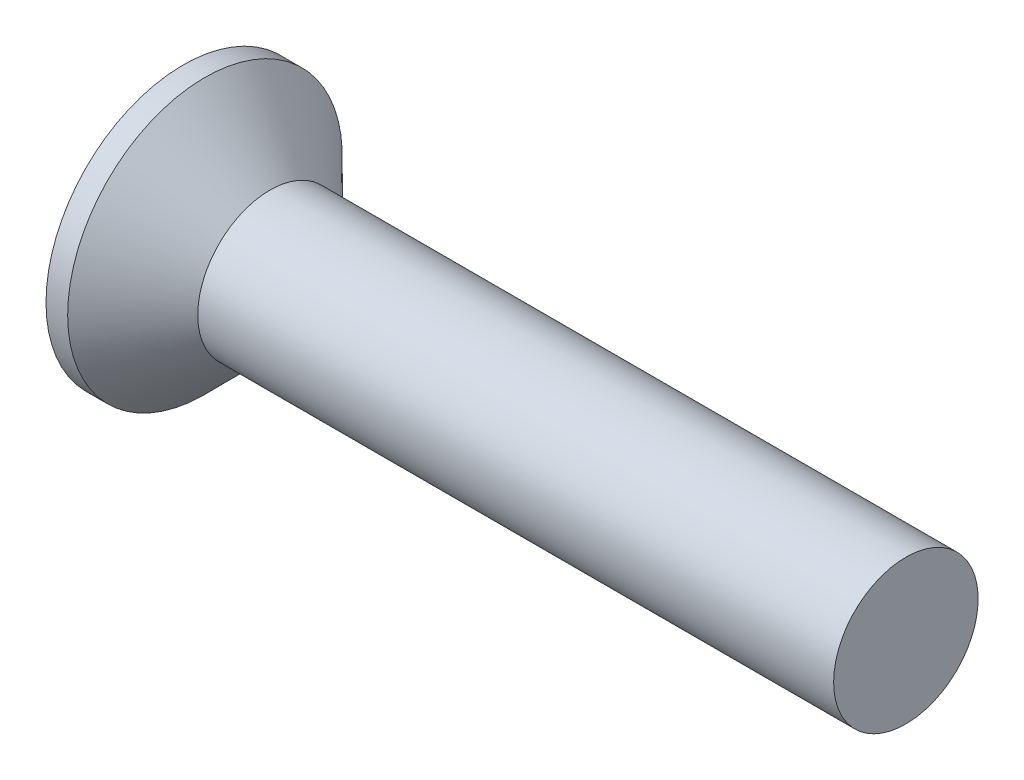
ISO-10303-21;
HEADER;
FILE_DESCRIPTION(('STEP AP214'),'2;1');
FILE_NAME('part.step','',(''),(''),'','','');
FILE_SCHEMA(('AUTOMOTIVE_DESIGN { 1 0 10303 214 1 1 1 1 }'));
ENDSEC;
DATA;
#1=APPLICATION_CONTEXT('core data for automotive mechanical design processes');
#2=APPLICATION_PROTOCOL_DEFINITION('international standard','automotive_design',2000,#1);
#3=PRODUCT_CONTEXT('',#1,'mechanical');
#4=PRODUCT('Part','Part','',(#3));
#5=PRODUCT_RELATED_PRODUCT_CATEGORY('part','',(#4));
#6=PRODUCT_DEFINITION_FORMATION('','',#4);
#7=PRODUCT_DEFINITION_CONTEXT('part definition',#1,'design');
#8=PRODUCT_DEFINITION('design','',#6,#7);
#9=PRODUCT_DEFINITION_SHAPE('','',#8);
#10=(LENGTH_UNIT() NAMED_UNIT(*) SI_UNIT(.MILLI.,.METRE.));
#11=(NAMED_UNIT(*) PLANE_ANGLE_UNIT() SI_UNIT($,.RADIAN.));
#12=(NAMED_UNIT(*) SI_UNIT($,.STERADIAN.) SOLID_ANGLE_UNIT());
#13=UNCERTAINTY_MEASURE_WITH_UNIT(LENGTH_MEASURE(1.E-05),#10,'distance_accuracy_value','');
#14=(GEOMETRIC_REPRESENTATION_CONTEXT(3) GLOBAL_UNCERTAINTY_ASSIGNED_CONTEXT((#13)) GLOBAL_UNIT_ASSIGNED_CONTEXT((#10,
#11,#12)) REPRESENTATION_CONTEXT('',''));
#15=CARTESIAN_POINT('',(0.,0.,0.));
#16=DIRECTION('',(0.,0.,1.));
#17=DIRECTION('',(1.,0.,0.));
#18=AXIS2_PLACEMENT_3D('',#15,#16,#17);
#19=CARTESIAN_POINT('',(0.,0.,0.));
#20=DIRECTION('',(-1.,0.,0.));
#21=DIRECTION('',(0.,0.,1.));
#22=AXIS2_PLACEMENT_3D('',#19,#20,#21);
#23=PLANE('',#22);
#24=CARTESIAN_POINT('',(0.,0.,0.));
#25=DIRECTION('',(-1.,0.,0.));
#26=DIRECTION('',(0.,0.,1.));
#27=AXIS2_PLACEMENT_3D('',#24,#25,#26);
#28=CIRCLE('',#27,1.9);
#29=CARTESIAN_POINT('',(0.,0.,1.9));
#30=VERTEX_POINT('',#29);
#31=EDGE_CURVE('E57',#30,#30,#28,.T.);
#32=ORIENTED_EDGE('',*,*,#31,.T.);
#33=EDGE_LOOP('',(#32));
#34=FACE_BOUND('',#33,.T.);
#35=DIRECTION('',(0.,1.,0.));
#36=VECTOR('',#35,1.);
#37=CARTESIAN_POINT('',(0.,-1.07,-0.264999999999999));
#38=LINE('',#37,#36);
#39=CARTESIAN_POINT('',(0.,-1.07,-0.264999999999999));
#40=VERTEX_POINT('',#39);
#41=CARTESIAN_POINT('',(0.,-0.264999999999999,-0.264999999999999));
#42=VERTEX_POINT('',#41);
#43=EDGE_CURVE('E119',#40,#42,#38,.T.);
#44=ORIENTED_EDGE('',*,*,#43,.T.);
#45=DIRECTION('',(0.,0.,-1.));
#46=VECTOR('',#45,1.);
#47=CARTESIAN_POINT('',(0.,-0.265000000000004,1.07));
#48=LINE('',#47,#46);
#49=CARTESIAN_POINT('',(0.,-0.264999999999996,-1.07));
#50=VERTEX_POINT('',#49);
#51=EDGE_CURVE('E98',#42,#50,#48,.T.);
#52=ORIENTED_EDGE('',*,*,#51,.T.);
#53=DIRECTION('',(0.,1.,0.));
#54=VECTOR('',#53,1.);
#55=CARTESIAN_POINT('',(0.,-0.264999999999996,-1.07));
#56=LINE('',#55,#54);
#57=CARTESIAN_POINT('',(0.,0.265000000000003,-1.07));
#58=VERTEX_POINT('',#57);
#59=EDGE_CURVE('E362',#50,#58,#56,.T.);
#60=ORIENTED_EDGE('',*,*,#59,.T.);
#61=DIRECTION('',(0.,0.,1.));
#62=VECTOR('',#61,1.);
#63=CARTESIAN_POINT('',(0.,0.265000000000003,-1.07));
#64=LINE('',#63,#62);
#65=CARTESIAN_POINT('',(0.,0.265,-0.264999999999999));
#66=VERTEX_POINT('',#65);
#67=EDGE_CURVE('E114',#58,#66,#64,.T.);
#68=ORIENTED_EDGE('',*,*,#67,.T.);
#69=CARTESIAN_POINT('',(0.,1.07,-0.264999999999999));
#70=VERTEX_POINT('',#69);
#71=EDGE_CURVE('E108',#66,#70,#38,.T.);
#72=ORIENTED_EDGE('',*,*,#71,.T.);
#73=DIRECTION('',(0.,0.,1.));
#74=VECTOR('',#73,1.);
#75=CARTESIAN_POINT('',(0.,1.07,-0.264999999999999));
#76=LINE('',#75,#74);
#77=CARTESIAN_POINT('',(0.,1.07,0.265));
#78=VERTEX_POINT('',#77);
#79=EDGE_CURVE('E111',#70,#78,#76,.T.);
#80=ORIENTED_EDGE('',*,*,#79,.T.);
#81=DIRECTION('',(0.,-1.,0.));
#82=VECTOR('',#81,1.);
#83=CARTESIAN_POINT('',(0.,1.07,0.265));
#84=LINE('',#83,#82);
#85=CARTESIAN_POINT('',(0.,0.264999999999998,0.265));
#86=VERTEX_POINT('',#85);
#87=EDGE_CURVE('E381',#78,#86,#84,.T.);
#88=ORIENTED_EDGE('',*,*,#87,.T.);
#89=CARTESIAN_POINT('',(0.,0.264999999999995,1.07));
#90=VERTEX_POINT('',#89);
#91=EDGE_CURVE('E353',#86,#90,#64,.T.);
#92=ORIENTED_EDGE('',*,*,#91,.T.);
#93=DIRECTION('',(0.,-1.,0.));
#94=VECTOR('',#93,1.);
#95=CARTESIAN_POINT('',(0.,0.264999999999995,1.07));
#96=LINE('',#95,#94);
#97=CARTESIAN_POINT('',(0.,-0.265000000000004,1.07));
#98=VERTEX_POINT('',#97);
#99=EDGE_CURVE('E338',#90,#98,#96,.T.);
#100=ORIENTED_EDGE('',*,*,#99,.T.);
#101=CARTESIAN_POINT('',(0.,-0.265000000000001,0.265));
#102=VERTEX_POINT('',#101);
#103=EDGE_CURVE('E351',#98,#102,#48,.T.);
#104=ORIENTED_EDGE('',*,*,#103,.T.);
#105=CARTESIAN_POINT('',(0.,-1.07,0.265));
#106=VERTEX_POINT('',#105);
#107=EDGE_CURVE('E126',#102,#106,#84,.T.);
#108=ORIENTED_EDGE('',*,*,#107,.T.);
#109=DIRECTION('',(0.,0.,-1.));
#110=VECTOR('',#109,1.);
#111=CARTESIAN_POINT('',(0.,-1.07,0.265));
#112=LINE('',#111,#110);
#113=EDGE_CURVE('E156',#106,#40,#112,.T.);
#114=ORIENTED_EDGE('',*,*,#113,.T.);
#115=EDGE_LOOP('',(#44,#52,#60,#68,#72,#80,#88,#92,#100,#104,#108,#114));
#116=FACE_BOUND('',#115,.T.);
#117=ADVANCED_FACE('F49',(#34,#116),#23,.T.);
#118=CARTESIAN_POINT('',(1.75765333333333,0.,0.113773333333333));
#119=DIRECTION('',(-0.0857222578731988,0.,-0.996319072639443));
#120=DIRECTION('',(-0.996319072639444,0.,0.0857222578731988));
#121=AXIS2_PLACEMENT_3D('',#118,#119,#120);
#122=PLANE('',#121);
#123=ORIENTED_EDGE('',*,*,#107,.F.);
#124=DIRECTION('',(0.992678495991953,0.0854090264408663,-0.085409026440866));
#125=VECTOR('',#124,1.);
#126=CARTESIAN_POINT('',(1.76729945793969,-0.112943390794151,0.112943390794151));
#127=LINE('',#126,#125);
#128=CARTESIAN_POINT('',(1.54,-0.132500000000001,0.1325));
#129=VERTEX_POINT('',#128);
#130=EDGE_CURVE('E150',#102,#129,#127,.T.);
#131=ORIENTED_EDGE('',*,*,#130,.T.);
#132=DIRECTION('',(0.851874354386278,0.518592342361776,-0.073294384387131));
#133=VECTOR('',#132,1.);
#134=CARTESIAN_POINT('',(0.,-1.07,0.265));
#135=LINE('',#134,#133);
#136=EDGE_CURVE('E120',#106,#129,#135,.T.);
#137=ORIENTED_EDGE('',*,*,#136,.F.);
#138=EDGE_LOOP('',(#123,#131,#137));
#139=FACE_BOUND('',#138,.T.);
#140=ADVANCED_FACE('F182',(#139),#122,.T.);
#141=DIRECTION('',(0.851874354386278,-0.518592342361776,-0.0732943843871309));
#142=VECTOR('',#141,1.);
#143=CARTESIAN_POINT('',(0.,1.07,0.265));
#144=LINE('',#143,#142);
#145=CARTESIAN_POINT('',(1.54,0.1325,0.1325));
#146=VERTEX_POINT('',#145);
#147=EDGE_CURVE('E64',#78,#146,#144,.T.);
#148=ORIENTED_EDGE('',*,*,#147,.T.);
#149=DIRECTION('',(-0.992678495991953,0.0854090264408653,0.085409026440866));
#150=VECTOR('',#149,1.);
#151=CARTESIAN_POINT('',(1.76729945793969,0.11294339079415,0.112943390794151));
#152=LINE('',#151,#150);
#153=EDGE_CURVE('E375',#146,#86,#152,.T.);
#154=ORIENTED_EDGE('',*,*,#153,.T.);
#155=ORIENTED_EDGE('',*,*,#87,.F.);
#156=EDGE_LOOP('',(#148,#154,#155));
#157=FACE_BOUND('',#156,.T.);
#158=ADVANCED_FACE('F187',(#157),#122,.T.);
#159=CARTESIAN_POINT('',(1.75765333333333,0.,-0.113773333333333));
#160=DIRECTION('',(-0.0857222578731983,0.,0.996319072639443));
#161=DIRECTION('',(0.996319072639444,0.,0.0857222578731983));
#162=AXIS2_PLACEMENT_3D('',#159,#160,#161);
#163=PLANE('',#162);
#164=DIRECTION('',(0.851874354386278,0.518592342361776,0.0732943843871306));
#165=VECTOR('',#164,1.);
#166=CARTESIAN_POINT('',(0.,-1.07,-0.264999999999999));
#167=LINE('',#166,#165);
#168=CARTESIAN_POINT('',(1.54,-0.1325,-0.132500000000001));
#169=VERTEX_POINT('',#168);
#170=EDGE_CURVE('E73',#40,#169,#167,.T.);
#171=ORIENTED_EDGE('',*,*,#170,.T.);
#172=DIRECTION('',(-0.992678495991953,-0.0854090264408657,-0.0854090264408656));
#173=VECTOR('',#172,1.);
#174=CARTESIAN_POINT('',(1.76729945793969,-0.11294339079415,-0.11294339079415));
#175=LINE('',#174,#173);
#176=EDGE_CURVE('E11',#169,#42,#175,.T.);
#177=ORIENTED_EDGE('',*,*,#176,.T.);
#178=ORIENTED_EDGE('',*,*,#43,.F.);
#179=EDGE_LOOP('',(#171,#177,#178));
#180=FACE_BOUND('',#179,.T.);
#181=ADVANCED_FACE('F179',(#180),#163,.T.);
#182=ORIENTED_EDGE('',*,*,#71,.F.);
#183=DIRECTION('',(0.992678495991953,-0.0854090264408659,0.0854090264408656));
#184=VECTOR('',#183,1.);
#185=CARTESIAN_POINT('',(1.76729945793969,0.112943390794151,-0.11294339079415));
#186=LINE('',#185,#184);
#187=CARTESIAN_POINT('',(1.54,0.1325,-0.1325));
#188=VERTEX_POINT('',#187);
#189=EDGE_CURVE('E129',#66,#188,#186,.T.);
#190=ORIENTED_EDGE('',*,*,#189,.T.);
#191=DIRECTION('',(0.851874354386278,-0.518592342361776,0.0732943843871306));
#192=VECTOR('',#191,1.);
#193=CARTESIAN_POINT('',(0.,1.07,-0.264999999999999));
#194=LINE('',#193,#192);
#195=EDGE_CURVE('E124',#70,#188,#194,.T.);
#196=ORIENTED_EDGE('',*,*,#195,.F.);
#197=EDGE_LOOP('',(#182,#190,#196));
#198=FACE_BOUND('',#197,.T.);
#199=ADVANCED_FACE('F128',(#198),#163,.T.);
#200=CARTESIAN_POINT('',(-6.34999999999999,0.,0.));
#201=DIRECTION('',(-1.,0.,0.));
#202=DIRECTION('',(0.,0.,1.));
#203=AXIS2_PLACEMENT_3D('',#200,#201,#202);
#204=CYLINDRICAL_SURFACE('',#203,1.9);
#205=CARTESIAN_POINT('',(0.300000000000004,0.,0.));
#206=DIRECTION('',(-1.,0.,0.));
#207=DIRECTION('',(0.,0.,1.));
#208=AXIS2_PLACEMENT_3D('',#205,#206,#207);
#209=CIRCLE('',#208,1.9);
#210=CARTESIAN_POINT('',(0.300000000000004,0.,1.9));
#211=VERTEX_POINT('',#210);
#212=EDGE_CURVE('E160',#211,#211,#209,.T.);
#213=ORIENTED_EDGE('',*,*,#212,.T.);
#214=EDGE_LOOP('',(#213));
#215=FACE_BOUND('',#214,.T.);
#216=ORIENTED_EDGE('',*,*,#31,.F.);
#217=EDGE_LOOP('',(#216));
#218=FACE_BOUND('',#217,.T.);
#219=ADVANCED_FACE('F168',(#215,#218),#204,.T.);
#220=CARTESIAN_POINT('',(0.300000000000004,0.,0.));
#221=DIRECTION('',(-1.,0.,0.));
#222=DIRECTION('',(0.,0.,1.));
#223=AXIS2_PLACEMENT_3D('',#220,#221,#222);
#224=CONICAL_SURFACE('',#223,1.9,0.785398163397451);
#225=CARTESIAN_POINT('',(1.2,0.,0.));
#226=DIRECTION('',(-1.,0.,0.));
#227=DIRECTION('',(0.,0.,1.));
#228=AXIS2_PLACEMENT_3D('',#225,#226,#227);
#229=CIRCLE('',#228,1.);
#230=CARTESIAN_POINT('',(1.2,0.,1.));
#231=VERTEX_POINT('',#230);
#232=EDGE_CURVE('E155',#231,#231,#229,.T.);
#233=ORIENTED_EDGE('',*,*,#232,.T.);
#234=EDGE_LOOP('',(#233));
#235=FACE_BOUND('',#234,.T.);
#236=ORIENTED_EDGE('',*,*,#212,.F.);
#237=EDGE_LOOP('',(#236));
#238=FACE_BOUND('',#237,.T.);
#239=ADVANCED_FACE('F170',(#235,#238),#224,.T.);
#240=CARTESIAN_POINT('',(-6.34999999999999,0.,0.));
#241=DIRECTION('',(-1.,0.,0.));
#242=DIRECTION('',(0.,0.,1.));
#243=AXIS2_PLACEMENT_3D('',#240,#241,#242);
#244=CYLINDRICAL_SURFACE('',#243,1.);
#245=CARTESIAN_POINT('',(10.,0.,0.));
#246=DIRECTION('',(-1.,0.,0.));
#247=DIRECTION('',(0.,0.,1.));
#248=AXIS2_PLACEMENT_3D('',#245,#246,#247);
#249=CIRCLE('',#248,1.);
#250=CARTESIAN_POINT('',(10.,0.,1.));
#251=VERTEX_POINT('',#250);
#252=EDGE_CURVE('E151',#251,#251,#249,.T.);
#253=ORIENTED_EDGE('',*,*,#252,.T.);
#254=EDGE_LOOP('',(#253));
#255=FACE_BOUND('',#254,.T.);
#256=ORIENTED_EDGE('',*,*,#232,.F.);
#257=EDGE_LOOP('',(#256));
#258=FACE_BOUND('',#257,.T.);
#259=ADVANCED_FACE('F175',(#255,#258),#244,.T.);
#260=CARTESIAN_POINT('',(10.,1.,0.));
#261=DIRECTION('',(1.,0.,0.));
#262=DIRECTION('',(0.,0.,-1.));
#263=AXIS2_PLACEMENT_3D('',#260,#261,#262);
#264=PLANE('',#263);
#265=ORIENTED_EDGE('',*,*,#252,.F.);
#266=EDGE_LOOP('',(#265));
#267=FACE_BOUND('',#266,.T.);
#268=ADVANCED_FACE('F207',(#267),#264,.T.);
#269=CARTESIAN_POINT('',(1.54,0.1325,-0.1325));
#270=DIRECTION('',(1.,0.,0.));
#271=DIRECTION('',(0.,0.,-1.));
#272=AXIS2_PLACEMENT_3D('',#269,#270,#271);
#273=PLANE('',#272);
#274=DIRECTION('',(0.,1.,0.));
#275=VECTOR('',#274,1.);
#276=CARTESIAN_POINT('',(1.54,-0.1325,-0.1325));
#277=LINE('',#276,#275);
#278=EDGE_CURVE('E144',#169,#188,#277,.T.);
#279=ORIENTED_EDGE('',*,*,#278,.F.);
#280=DIRECTION('',(0.,0.,-1.));
#281=VECTOR('',#280,1.);
#282=CARTESIAN_POINT('',(1.54,-0.1325,0.1325));
#283=LINE('',#282,#281);
#284=EDGE_CURVE('E132',#129,#169,#283,.T.);
#285=ORIENTED_EDGE('',*,*,#284,.F.);
#286=DIRECTION('',(0.,-1.,0.));
#287=VECTOR('',#286,1.);
#288=CARTESIAN_POINT('',(1.54,0.1325,0.1325));
#289=LINE('',#288,#287);
#290=EDGE_CURVE('E137',#146,#129,#289,.T.);
#291=ORIENTED_EDGE('',*,*,#290,.F.);
#292=DIRECTION('',(0.,0.,1.));
#293=VECTOR('',#292,1.);
#294=CARTESIAN_POINT('',(1.54,0.1325,-0.1325));
#295=LINE('',#294,#293);
#296=EDGE_CURVE('E141',#188,#146,#295,.T.);
#297=ORIENTED_EDGE('',*,*,#296,.F.);
#298=EDGE_LOOP('',(#279,#285,#291,#297));
#299=FACE_BOUND('',#298,.T.);
#300=ADVANCED_FACE('F204',(#299),#273,.F.);
#301=CARTESIAN_POINT('',(1.54,-0.1325,-0.1325));
#302=DIRECTION('',(-0.519990936244092,0.854171777936963,0.));
#303=DIRECTION('',(-0.854171777936963,-0.519990936244092,0.));
#304=AXIS2_PLACEMENT_3D('',#301,#302,#303);
#305=PLANE('',#304);
#306=ORIENTED_EDGE('',*,*,#170,.F.);
#307=ORIENTED_EDGE('',*,*,#113,.F.);
#308=ORIENTED_EDGE('',*,*,#136,.T.);
#309=ORIENTED_EDGE('',*,*,#284,.T.);
#310=EDGE_LOOP('',(#306,#307,#308,#309));
#311=FACE_BOUND('',#310,.T.);
#312=ADVANCED_FACE('F196',(#311),#305,.T.);
#313=CARTESIAN_POINT('',(0.,1.07,0.265));
#314=DIRECTION('',(-0.519990936244092,-0.854171777936963,0.));
#315=DIRECTION('',(0.854171777936963,-0.519990936244092,0.));
#316=AXIS2_PLACEMENT_3D('',#313,#314,#315);
#317=PLANE('',#316);
#318=ORIENTED_EDGE('',*,*,#147,.F.);
#319=ORIENTED_EDGE('',*,*,#79,.F.);
#320=ORIENTED_EDGE('',*,*,#195,.T.);
#321=ORIENTED_EDGE('',*,*,#296,.T.);
#322=EDGE_LOOP('',(#318,#319,#320,#321));
#323=FACE_BOUND('',#322,.T.);
#324=ADVANCED_FACE('F123',(#323),#317,.T.);
#325=CARTESIAN_POINT('',(1.75765333333333,-0.113773333333333,0.));
#326=DIRECTION('',(-0.0857222578731988,0.996319072639443,0.));
#327=DIRECTION('',(-0.996319072639444,-0.0857222578731988,0.));
#328=AXIS2_PLACEMENT_3D('',#325,#326,#327);
#329=PLANE('',#328);
#330=DIRECTION('',(0.851874354386278,0.0732943843871292,0.518592342361776));
#331=VECTOR('',#330,1.);
#332=CARTESIAN_POINT('',(0.,-0.264999999999996,-1.07));
#333=LINE('',#332,#331);
#334=EDGE_CURVE('E365',#50,#169,#333,.T.);
#335=ORIENTED_EDGE('',*,*,#334,.F.);
#336=ORIENTED_EDGE('',*,*,#51,.F.);
#337=ORIENTED_EDGE('',*,*,#176,.F.);
#338=EDGE_LOOP('',(#335,#336,#337));
#339=FACE_BOUND('',#338,.T.);
#340=ADVANCED_FACE('F203',(#339),#329,.T.);
#341=CARTESIAN_POINT('',(1.75765333333333,0.113773333333333,0.));
#342=DIRECTION('',(-0.0857222578731983,-0.996319072639443,0.));
#343=DIRECTION('',(0.996319072639444,-0.0857222578731983,0.));
#344=AXIS2_PLACEMENT_3D('',#341,#342,#343);
#345=PLANE('',#344);
#346=ORIENTED_EDGE('',*,*,#67,.F.);
#347=DIRECTION('',(0.851874354386278,-0.0732943843871324,0.518592342361776));
#348=VECTOR('',#347,1.);
#349=CARTESIAN_POINT('',(0.,0.265000000000003,-1.07));
#350=LINE('',#349,#348);
#351=EDGE_CURVE('E89',#58,#188,#350,.T.);
#352=ORIENTED_EDGE('',*,*,#351,.T.);
#353=ORIENTED_EDGE('',*,*,#189,.F.);
#354=EDGE_LOOP('',(#346,#352,#353));
#355=FACE_BOUND('',#354,.T.);
#356=ADVANCED_FACE('F283',(#355),#345,.T.);
#357=CARTESIAN_POINT('',(1.54,0.1325,-0.1325));
#358=DIRECTION('',(-0.519990936244092,0.,0.854171777936963));
#359=DIRECTION('',(-0.854171777936963,0.,-0.519990936244092));
#360=AXIS2_PLACEMENT_3D('',#357,#358,#359);
#361=PLANE('',#360);
#362=ORIENTED_EDGE('',*,*,#351,.F.);
#363=ORIENTED_EDGE('',*,*,#59,.F.);
#364=ORIENTED_EDGE('',*,*,#334,.T.);
#365=ORIENTED_EDGE('',*,*,#278,.T.);
#366=EDGE_LOOP('',(#362,#363,#364,#365));
#367=FACE_BOUND('',#366,.T.);
#368=ADVANCED_FACE('F293',(#367),#361,.T.);
#369=ORIENTED_EDGE('',*,*,#103,.F.);
#370=DIRECTION('',(0.851874354386278,0.0732943843871327,-0.518592342361776));
#371=VECTOR('',#370,1.);
#372=CARTESIAN_POINT('',(0.,-0.265000000000004,1.07));
#373=LINE('',#372,#371);
#374=EDGE_CURVE('E335',#98,#129,#373,.T.);
#375=ORIENTED_EDGE('',*,*,#374,.T.);
#376=ORIENTED_EDGE('',*,*,#130,.F.);
#377=EDGE_LOOP('',(#369,#375,#376));
#378=FACE_BOUND('',#377,.T.);
#379=ADVANCED_FACE('F285',(#378),#329,.T.);
#380=DIRECTION('',(0.851874354386278,-0.0732943843871288,-0.518592342361776));
#381=VECTOR('',#380,1.);
#382=CARTESIAN_POINT('',(0.,0.264999999999995,1.07));
#383=LINE('',#382,#381);
#384=EDGE_CURVE('E347',#90,#146,#383,.T.);
#385=ORIENTED_EDGE('',*,*,#384,.F.);
#386=ORIENTED_EDGE('',*,*,#91,.F.);
#387=ORIENTED_EDGE('',*,*,#153,.F.);
#388=EDGE_LOOP('',(#385,#386,#387));
#389=FACE_BOUND('',#388,.T.);
#390=ADVANCED_FACE('F295',(#389),#345,.T.);
#391=CARTESIAN_POINT('',(0.,-0.265000000000004,1.07));
#392=DIRECTION('',(-0.519990936244092,0.,-0.854171777936963));
#393=DIRECTION('',(0.854171777936963,0.,-0.519990936244092));
#394=AXIS2_PLACEMENT_3D('',#391,#392,#393);
#395=PLANE('',#394);
#396=ORIENTED_EDGE('',*,*,#374,.F.);
#397=ORIENTED_EDGE('',*,*,#99,.F.);
#398=ORIENTED_EDGE('',*,*,#384,.T.);
#399=ORIENTED_EDGE('',*,*,#290,.T.);
#400=EDGE_LOOP('',(#396,#397,#398,#399));
#401=FACE_BOUND('',#400,.T.);
#402=ADVANCED_FACE('F320',(#401),#395,.T.);
#403=CLOSED_SHELL('',(#117,#140,#158,#181,#199,#219,#239,#259,#268,#300,#312,#324,#340,#356,
#368,#379,#390,#402));
#404=MANIFOLD_SOLID_BREP('B2',#403);
#405=ADVANCED_BREP_SHAPE_REPRESENTATION('',(#18,#404),#14);
#406=SHAPE_DEFINITION_REPRESENTATION(#9,#405);
ENDSEC;
END-ISO-10303-21;
